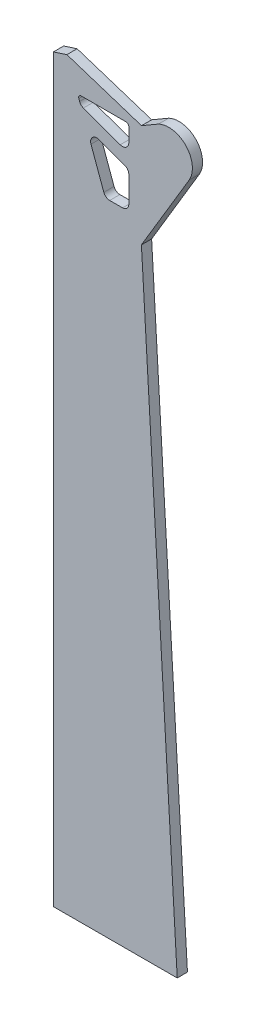
ISO-10303-21;
HEADER;
FILE_DESCRIPTION(('STEP AP214'),'2;1');
FILE_NAME('part.step','',(''),(''),'','','');
FILE_SCHEMA(('AUTOMOTIVE_DESIGN { 1 0 10303 214 1 1 1 1 }'));
ENDSEC;
DATA;
#1=APPLICATION_CONTEXT('core data for automotive mechanical design processes');
#2=APPLICATION_PROTOCOL_DEFINITION('international standard','automotive_design',2000,#1);
#3=PRODUCT_CONTEXT('',#1,'mechanical');
#4=PRODUCT('Part','Part','',(#3));
#5=PRODUCT_RELATED_PRODUCT_CATEGORY('part','',(#4));
#6=PRODUCT_DEFINITION_FORMATION('','',#4);
#7=PRODUCT_DEFINITION_CONTEXT('part definition',#1,'design');
#8=PRODUCT_DEFINITION('design','',#6,#7);
#9=PRODUCT_DEFINITION_SHAPE('','',#8);
#10=(LENGTH_UNIT() NAMED_UNIT(*) SI_UNIT(.MILLI.,.METRE.));
#11=(NAMED_UNIT(*) PLANE_ANGLE_UNIT() SI_UNIT($,.RADIAN.));
#12=(NAMED_UNIT(*) SI_UNIT($,.STERADIAN.) SOLID_ANGLE_UNIT());
#13=UNCERTAINTY_MEASURE_WITH_UNIT(LENGTH_MEASURE(1.E-05),#10,'distance_accuracy_value','');
#14=(GEOMETRIC_REPRESENTATION_CONTEXT(3) GLOBAL_UNCERTAINTY_ASSIGNED_CONTEXT((#13)) GLOBAL_UNIT_ASSIGNED_CONTEXT((#10,
#11,#12)) REPRESENTATION_CONTEXT('',''));
#15=CARTESIAN_POINT('',(0.,0.,0.));
#16=DIRECTION('',(0.,0.,1.));
#17=DIRECTION('',(1.,0.,0.));
#18=AXIS2_PLACEMENT_3D('',#15,#16,#17);
#19=CARTESIAN_POINT('',(28.6298346878982,-20.0325012091891,4.));
#20=DIRECTION('',(0.,0.,1.));
#21=DIRECTION('',(1.,0.,0.));
#22=AXIS2_PLACEMENT_3D('',#19,#20,#21);
#23=PLANE('',#22);
#24=DIRECTION('',(-0.951071645924449,0.308970426284716,0.));
#25=VECTOR('',#24,1.);
#26=CARTESIAN_POINT('',(-11.3096668241199,-6.06976293128026,4.));
#27=LINE('',#26,#25);
#28=CARTESIAN_POINT('',(17.9385185515101,-15.5714911578419,4.));
#29=VERTEX_POINT('',#28);
#30=CARTESIAN_POINT('',(-11.3096668241199,-6.06976293128026,4.));
#31=VERTEX_POINT('',#30);
#32=EDGE_CURVE('E318',#29,#31,#27,.T.);
#33=ORIENTED_EDGE('',*,*,#32,.T.);
#34=DIRECTION('',(-0.951147790313558,-0.308735940540837,0.));
#35=VECTOR('',#34,1.);
#36=CARTESIAN_POINT('',(-16.5920986699063,-7.78440347490604,4.));
#37=LINE('',#36,#35);
#38=CARTESIAN_POINT('',(-16.5920986699063,-7.78440347490604,4.));
#39=VERTEX_POINT('',#38);
#40=EDGE_CURVE('E321',#31,#39,#37,.T.);
#41=ORIENTED_EDGE('',*,*,#40,.T.);
#42=DIRECTION('',(0.,-1.,0.));
#43=VECTOR('',#42,1.);
#44=CARTESIAN_POINT('',(-16.5920986699063,-298.052484048209,4.));
#45=LINE('',#44,#43);
#46=CARTESIAN_POINT('',(-16.5920986699063,-298.052484048209,4.));
#47=VERTEX_POINT('',#46);
#48=EDGE_CURVE('E324',#39,#47,#45,.T.);
#49=ORIENTED_EDGE('',*,*,#48,.T.);
#50=DIRECTION('',(0.999999415520695,0.00108118373476207,0.));
#51=VECTOR('',#50,1.);
#52=CARTESIAN_POINT('',(31.9511618521957,-297.999999833824,4.));
#53=LINE('',#52,#51);
#54=CARTESIAN_POINT('',(31.9511618521957,-297.999999833824,4.));
#55=VERTEX_POINT('',#54);
#56=EDGE_CURVE('E326',#47,#55,#53,.T.);
#57=ORIENTED_EDGE('',*,*,#56,.T.);
#58=DIRECTION('',(-0.0579668894927901,0.998318506150482,0.));
#59=VECTOR('',#58,1.);
#60=CARTESIAN_POINT('',(17.9029399136455,-56.0584352185921,4.));
#61=LINE('',#60,#59);
#62=CARTESIAN_POINT('',(17.9029399136455,-56.0584352185921,4.));
#63=VERTEX_POINT('',#62);
#64=EDGE_CURVE('E328',#55,#63,#61,.T.);
#65=ORIENTED_EDGE('',*,*,#64,.T.);
#66=DIRECTION('',(0.512634877183394,0.85860671013868,0.));
#67=VECTOR('',#66,1.);
#68=CARTESIAN_POINT('',(36.6247857009395,-24.7014145892651,4.));
#69=LINE('',#68,#67);
#70=CARTESIAN_POINT('',(36.6247857009395,-24.7014145892651,4.));
#71=VERTEX_POINT('',#70);
#72=EDGE_CURVE('E330',#63,#71,#69,.T.);
#73=ORIENTED_EDGE('',*,*,#72,.T.);
#74=CARTESIAN_POINT('',(28.6298346878982,-20.0325012091891,4.));
#75=DIRECTION('',(0.,0.,1.));
#76=DIRECTION('',(1.,0.,0.));
#77=AXIS2_PLACEMENT_3D('',#74,#75,#76);
#78=CIRCLE('',#77,9.25840125786205);
#79=CARTESIAN_POINT('',(24.5925930532673,-11.7007142558889,4.));
#80=VERTEX_POINT('',#79);
#81=EDGE_CURVE('E332',#71,#80,#78,.T.);
#82=ORIENTED_EDGE('',*,*,#81,.T.);
#83=DIRECTION('',(-0.864386993126988,-0.502827133429456,0.));
#84=VECTOR('',#83,1.);
#85=CARTESIAN_POINT('',(17.9385185515101,-15.5714911578419,4.));
#86=LINE('',#85,#84);
#87=EDGE_CURVE('E334',#80,#29,#86,.T.);
#88=ORIENTED_EDGE('',*,*,#87,.T.);
#89=EDGE_LOOP('',(#33,#41,#49,#57,#65,#73,#82,#88));
#90=FACE_BOUND('',#89,.T.);
#91=DIRECTION('',(-1.,0.,0.));
#92=VECTOR('',#91,1.);
#93=CARTESIAN_POINT('',(11.95,-17.302075787855,4.));
#94=LINE('',#93,#92);
#95=CARTESIAN_POINT('',(11.95,-17.302075787855,4.));
#96=VERTEX_POINT('',#95);
#97=CARTESIAN_POINT('',(-5.70114217944184,-17.302075787855,4.));
#98=VERTEX_POINT('',#97);
#99=EDGE_CURVE('E261',#96,#98,#94,.T.);
#100=ORIENTED_EDGE('',*,*,#99,.F.);
#101=CARTESIAN_POINT('',(11.95,-18.302075787855,4.));
#102=DIRECTION('',(0.,0.,1.));
#103=DIRECTION('',(1.,0.,0.));
#104=AXIS2_PLACEMENT_3D('',#101,#102,#103);
#105=CIRCLE('',#104,1.00000000000001);
#106=CARTESIAN_POINT('',(12.95,-18.3020757878549,4.));
#107=VERTEX_POINT('',#106);
#108=EDGE_CURVE('E259',#107,#96,#105,.T.);
#109=ORIENTED_EDGE('',*,*,#108,.F.);
#110=DIRECTION('',(0.,1.,0.));
#111=VECTOR('',#110,1.);
#112=CARTESIAN_POINT('',(12.95,-18.3020757878549,4.));
#113=LINE('',#112,#111);
#114=CARTESIAN_POINT('',(12.95,-23.8785925996651,4.));
#115=VERTEX_POINT('',#114);
#116=EDGE_CURVE('E275',#115,#107,#113,.T.);
#117=ORIENTED_EDGE('',*,*,#116,.F.);
#118=CARTESIAN_POINT('',(10.45,-23.8785925996651,4.));
#119=DIRECTION('',(0.,0.,1.));
#120=DIRECTION('',(1.,0.,0.));
#121=AXIS2_PLACEMENT_3D('',#118,#119,#120);
#122=CIRCLE('',#121,2.5);
#123=CARTESIAN_POINT('',(9.59494964168551,-26.2278241516297,4.));
#124=VERTEX_POINT('',#123);
#125=EDGE_CURVE('E272',#124,#115,#122,.T.);
#126=ORIENTED_EDGE('',*,*,#125,.F.);
#127=DIRECTION('',(0.939692620785861,-0.342020143325799,0.));
#128=VECTOR('',#127,1.);
#129=CARTESIAN_POINT('',(9.59494964168551,-26.2278241516297,4.));
#130=LINE('',#129,#128);
#131=CARTESIAN_POINT('',(-4.84288181869834,-20.9728832526956,4.));
#132=VERTEX_POINT('',#131);
#133=EDGE_CURVE('E270',#132,#124,#130,.T.);
#134=ORIENTED_EDGE('',*,*,#133,.F.);
#135=CARTESIAN_POINT('',(-3.98783146038417,-18.6236517007308,4.));
#136=DIRECTION('',(0.,0.,1.));
#137=DIRECTION('',(1.,0.,0.));
#138=AXIS2_PLACEMENT_3D('',#135,#136,#137);
#139=CIRCLE('',#138,2.5);
#140=CARTESIAN_POINT('',(-6.33706301234895,-19.478702059045,4.));
#141=VERTEX_POINT('',#140);
#142=EDGE_CURVE('E268',#141,#132,#139,.T.);
#143=ORIENTED_EDGE('',*,*,#142,.F.);
#144=DIRECTION('',(0.342020143325663,-0.939692620785911,0.));
#145=VECTOR('',#144,1.);
#146=CARTESIAN_POINT('',(-6.64083480022774,-18.6440959311806,4.));
#147=LINE('',#146,#145);
#148=CARTESIAN_POINT('',(-6.64083480022774,-18.6440959311806,4.));
#149=VERTEX_POINT('',#148);
#150=EDGE_CURVE('E266',#149,#141,#147,.T.);
#151=ORIENTED_EDGE('',*,*,#150,.F.);
#152=CARTESIAN_POINT('',(-5.70114217944184,-18.302075787855,4.));
#153=DIRECTION('',(0.,0.,1.));
#154=DIRECTION('',(-1.,0.,0.));
#155=AXIS2_PLACEMENT_3D('',#152,#153,#154);
#156=CIRCLE('',#155,0.999999999999999);
#157=EDGE_CURVE('E264',#98,#149,#156,.T.);
#158=ORIENTED_EDGE('',*,*,#157,.F.);
#159=EDGE_LOOP('',(#100,#109,#117,#126,#134,#143,#151,#158));
#160=FACE_BOUND('',#159,.T.);
#161=DIRECTION('',(0.342020143325663,-0.93969262078591,0.));
#162=VECTOR('',#161,1.);
#163=CARTESIAN_POINT('',(-1.86433279978723,-31.767427321371,4.));
#164=LINE('',#163,#162);
#165=CARTESIAN_POINT('',(-1.86433279978723,-31.767427321371,4.));
#166=VERTEX_POINT('',#165);
#167=CARTESIAN_POINT('',(3.16592584107175,-45.5879493511479,4.));
#168=VERTEX_POINT('',#167);
#169=EDGE_CURVE('E202',#166,#168,#164,.T.);
#170=ORIENTED_EDGE('',*,*,#169,.F.);
#171=CARTESIAN_POINT('',(0.437914121138236,-30.9294779702231,4.));
#172=DIRECTION('',(0.,0.,1.));
#173=DIRECTION('',(-1.,0.,0.));
#174=AXIS2_PLACEMENT_3D('',#171,#172,#173);
#175=CIRCLE('',#174,2.45);
#176=CARTESIAN_POINT('',(1.27586347228618,-28.6272310492977,4.));
#177=VERTEX_POINT('',#176);
#178=EDGE_CURVE('E194',#177,#166,#175,.T.);
#179=ORIENTED_EDGE('',*,*,#178,.F.);
#180=DIRECTION('',(-0.939692620785907,0.342020143325672,0.));
#181=VECTOR('',#180,1.);
#182=CARTESIAN_POINT('',(1.27586347228618,-28.6272310492977,4.));
#183=LINE('',#182,#181);
#184=CARTESIAN_POINT('',(11.3379493511479,-32.2895308038337,4.));
#185=VERTEX_POINT('',#184);
#186=EDGE_CURVE('E227',#185,#177,#183,.T.);
#187=ORIENTED_EDGE('',*,*,#186,.F.);
#188=CARTESIAN_POINT('',(10.5,-34.5917777247591,4.));
#189=DIRECTION('',(0.,0.,1.));
#190=DIRECTION('',(-1.,0.,0.));
#191=AXIS2_PLACEMENT_3D('',#188,#189,#190);
#192=CIRCLE('',#191,2.45);
#193=CARTESIAN_POINT('',(12.95,-34.5917777247591,4.));
#194=VERTEX_POINT('',#193);
#195=EDGE_CURVE('E225',#194,#185,#192,.T.);
#196=ORIENTED_EDGE('',*,*,#195,.F.);
#197=DIRECTION('',(0.,1.,0.));
#198=VECTOR('',#197,1.);
#199=CARTESIAN_POINT('',(12.95,-34.5917777247591,4.));
#200=LINE('',#199,#198);
#201=CARTESIAN_POINT('',(12.95,-44.75,4.));
#202=VERTEX_POINT('',#201);
#203=EDGE_CURVE('E223',#202,#194,#200,.T.);
#204=ORIENTED_EDGE('',*,*,#203,.F.);
#205=CARTESIAN_POINT('',(10.5,-44.75,4.));
#206=DIRECTION('',(0.,0.,1.));
#207=DIRECTION('',(1.,0.,0.));
#208=AXIS2_PLACEMENT_3D('',#205,#206,#207);
#209=CIRCLE('',#208,2.45);
#210=CARTESIAN_POINT('',(10.5,-47.2,4.));
#211=VERTEX_POINT('',#210);
#212=EDGE_CURVE('E221',#211,#202,#209,.T.);
#213=ORIENTED_EDGE('',*,*,#212,.F.);
#214=DIRECTION('',(1.,0.,0.));
#215=VECTOR('',#214,1.);
#216=CARTESIAN_POINT('',(5.46817276199725,-47.2,4.));
#217=LINE('',#216,#215);
#218=CARTESIAN_POINT('',(5.46817276199725,-47.2,4.));
#219=VERTEX_POINT('',#218);
#220=EDGE_CURVE('E217',#219,#211,#217,.T.);
#221=ORIENTED_EDGE('',*,*,#220,.F.);
#222=CARTESIAN_POINT('',(5.46817276199724,-44.75,4.));
#223=DIRECTION('',(0.,0.,1.));
#224=DIRECTION('',(-1.,0.,0.));
#225=AXIS2_PLACEMENT_3D('',#222,#223,#224);
#226=CIRCLE('',#225,2.45);
#227=EDGE_CURVE('E215',#168,#219,#226,.T.);
#228=ORIENTED_EDGE('',*,*,#227,.F.);
#229=EDGE_LOOP('',(#170,#179,#187,#196,#204,#213,#221,#228));
#230=FACE_BOUND('',#229,.T.);
#231=ADVANCED_FACE('F33',(#90,#160,#230),#23,.T.);
#232=CARTESIAN_POINT('',(28.6298346878982,-20.0325012091891,0.));
#233=DIRECTION('',(0.,0.,1.));
#234=DIRECTION('',(1.,0.,0.));
#235=AXIS2_PLACEMENT_3D('',#232,#233,#234);
#236=PLANE('',#235);
#237=CARTESIAN_POINT('',(11.95,-18.302075787855,0.));
#238=DIRECTION('',(0.,0.,1.));
#239=DIRECTION('',(1.,0.,0.));
#240=AXIS2_PLACEMENT_3D('',#237,#238,#239);
#241=CIRCLE('',#240,1.00000000000001);
#242=CARTESIAN_POINT('',(12.95,-18.3020757878549,0.));
#243=VERTEX_POINT('',#242);
#244=CARTESIAN_POINT('',(11.95,-17.302075787855,0.));
#245=VERTEX_POINT('',#244);
#246=EDGE_CURVE('E210',#243,#245,#241,.T.);
#247=ORIENTED_EDGE('',*,*,#246,.T.);
#248=DIRECTION('',(-1.,0.,0.));
#249=VECTOR('',#248,1.);
#250=CARTESIAN_POINT('',(11.95,-17.302075787855,0.));
#251=LINE('',#250,#249);
#252=CARTESIAN_POINT('',(-5.70114217944184,-17.302075787855,0.));
#253=VERTEX_POINT('',#252);
#254=EDGE_CURVE('E280',#245,#253,#251,.T.);
#255=ORIENTED_EDGE('',*,*,#254,.T.);
#256=CARTESIAN_POINT('',(-5.70114217944184,-18.302075787855,0.));
#257=DIRECTION('',(0.,0.,1.));
#258=DIRECTION('',(-1.,0.,0.));
#259=AXIS2_PLACEMENT_3D('',#256,#257,#258);
#260=CIRCLE('',#259,0.999999999999999);
#261=CARTESIAN_POINT('',(-6.64083480022774,-18.6440959311806,0.));
#262=VERTEX_POINT('',#261);
#263=EDGE_CURVE('E283',#253,#262,#260,.T.);
#264=ORIENTED_EDGE('',*,*,#263,.T.);
#265=DIRECTION('',(0.342020143325663,-0.939692620785911,0.));
#266=VECTOR('',#265,1.);
#267=CARTESIAN_POINT('',(-6.64083480022774,-18.6440959311806,0.));
#268=LINE('',#267,#266);
#269=CARTESIAN_POINT('',(-6.33706301234895,-19.478702059045,0.));
#270=VERTEX_POINT('',#269);
#271=EDGE_CURVE('E286',#262,#270,#268,.T.);
#272=ORIENTED_EDGE('',*,*,#271,.T.);
#273=CARTESIAN_POINT('',(-3.98783146038417,-18.6236517007308,0.));
#274=DIRECTION('',(0.,0.,1.));
#275=DIRECTION('',(1.,0.,0.));
#276=AXIS2_PLACEMENT_3D('',#273,#274,#275);
#277=CIRCLE('',#276,2.5);
#278=CARTESIAN_POINT('',(-4.84288181869834,-20.9728832526956,0.));
#279=VERTEX_POINT('',#278);
#280=EDGE_CURVE('E289',#270,#279,#277,.T.);
#281=ORIENTED_EDGE('',*,*,#280,.T.);
#282=DIRECTION('',(0.939692620785861,-0.342020143325799,0.));
#283=VECTOR('',#282,1.);
#284=CARTESIAN_POINT('',(9.59494964168551,-26.2278241516297,0.));
#285=LINE('',#284,#283);
#286=CARTESIAN_POINT('',(9.59494964168551,-26.2278241516297,0.));
#287=VERTEX_POINT('',#286);
#288=EDGE_CURVE('E292',#279,#287,#285,.T.);
#289=ORIENTED_EDGE('',*,*,#288,.T.);
#290=CARTESIAN_POINT('',(10.45,-23.8785925996651,0.));
#291=DIRECTION('',(0.,0.,1.));
#292=DIRECTION('',(1.,0.,0.));
#293=AXIS2_PLACEMENT_3D('',#290,#291,#292);
#294=CIRCLE('',#293,2.5);
#295=CARTESIAN_POINT('',(12.95,-23.8785925996651,0.));
#296=VERTEX_POINT('',#295);
#297=EDGE_CURVE('E295',#287,#296,#294,.T.);
#298=ORIENTED_EDGE('',*,*,#297,.T.);
#299=DIRECTION('',(0.,1.,0.));
#300=VECTOR('',#299,1.);
#301=CARTESIAN_POINT('',(12.95,-18.3020757878549,0.));
#302=LINE('',#301,#300);
#303=EDGE_CURVE('E262',#296,#243,#302,.T.);
#304=ORIENTED_EDGE('',*,*,#303,.T.);
#305=EDGE_LOOP('',(#247,#255,#264,#272,#281,#289,#298,#304));
#306=FACE_BOUND('',#305,.T.);
#307=DIRECTION('',(-0.951071645924449,0.308970426284716,0.));
#308=VECTOR('',#307,1.);
#309=CARTESIAN_POINT('',(-11.3096668241199,-6.06976293128026,0.));
#310=LINE('',#309,#308);
#311=CARTESIAN_POINT('',(17.9385185515101,-15.5714911578419,0.));
#312=VERTEX_POINT('',#311);
#313=CARTESIAN_POINT('',(-11.3096668241199,-6.06976293128026,0.));
#314=VERTEX_POINT('',#313);
#315=EDGE_CURVE('E317',#312,#314,#310,.T.);
#316=ORIENTED_EDGE('',*,*,#315,.F.);
#317=DIRECTION('',(-0.864386993126988,-0.502827133429456,0.));
#318=VECTOR('',#317,1.);
#319=CARTESIAN_POINT('',(17.9385185515101,-15.5714911578419,0.));
#320=LINE('',#319,#318);
#321=CARTESIAN_POINT('',(24.5925930532673,-11.7007142558889,0.));
#322=VERTEX_POINT('',#321);
#323=EDGE_CURVE('E322',#322,#312,#320,.T.);
#324=ORIENTED_EDGE('',*,*,#323,.F.);
#325=CARTESIAN_POINT('',(28.6298346878982,-20.0325012091891,0.));
#326=DIRECTION('',(0.,0.,1.));
#327=DIRECTION('',(1.,0.,0.));
#328=AXIS2_PLACEMENT_3D('',#325,#326,#327);
#329=CIRCLE('',#328,9.25840125786205);
#330=CARTESIAN_POINT('',(36.6247857009395,-24.7014145892651,0.));
#331=VERTEX_POINT('',#330);
#332=EDGE_CURVE('E349',#331,#322,#329,.T.);
#333=ORIENTED_EDGE('',*,*,#332,.F.);
#334=DIRECTION('',(0.512634877183394,0.85860671013868,0.));
#335=VECTOR('',#334,1.);
#336=CARTESIAN_POINT('',(36.6247857009395,-24.7014145892651,0.));
#337=LINE('',#336,#335);
#338=CARTESIAN_POINT('',(17.9029399136455,-56.0584352185921,0.));
#339=VERTEX_POINT('',#338);
#340=EDGE_CURVE('E347',#339,#331,#337,.T.);
#341=ORIENTED_EDGE('',*,*,#340,.F.);
#342=DIRECTION('',(-0.0579668894927901,0.998318506150482,0.));
#343=VECTOR('',#342,1.);
#344=CARTESIAN_POINT('',(17.9029399136455,-56.0584352185921,0.));
#345=LINE('',#344,#343);
#346=CARTESIAN_POINT('',(31.9511618521957,-297.999999833824,0.));
#347=VERTEX_POINT('',#346);
#348=EDGE_CURVE('E345',#347,#339,#345,.T.);
#349=ORIENTED_EDGE('',*,*,#348,.F.);
#350=DIRECTION('',(0.999999415520695,0.00108118373476207,0.));
#351=VECTOR('',#350,1.);
#352=CARTESIAN_POINT('',(31.9511618521957,-297.999999833824,0.));
#353=LINE('',#352,#351);
#354=CARTESIAN_POINT('',(-16.5920986699063,-298.052484048209,0.));
#355=VERTEX_POINT('',#354);
#356=EDGE_CURVE('E343',#355,#347,#353,.T.);
#357=ORIENTED_EDGE('',*,*,#356,.F.);
#358=DIRECTION('',(0.,-1.,0.));
#359=VECTOR('',#358,1.);
#360=CARTESIAN_POINT('',(-16.5920986699063,-298.052484048209,0.));
#361=LINE('',#360,#359);
#362=CARTESIAN_POINT('',(-16.5920986699063,-7.78440347490604,0.));
#363=VERTEX_POINT('',#362);
#364=EDGE_CURVE('E341',#363,#355,#361,.T.);
#365=ORIENTED_EDGE('',*,*,#364,.F.);
#366=DIRECTION('',(-0.951147790313558,-0.308735940540837,0.));
#367=VECTOR('',#366,1.);
#368=CARTESIAN_POINT('',(-16.5920986699063,-7.78440347490604,0.));
#369=LINE('',#368,#367);
#370=EDGE_CURVE('E339',#314,#363,#369,.T.);
#371=ORIENTED_EDGE('',*,*,#370,.F.);
#372=EDGE_LOOP('',(#316,#324,#333,#341,#349,#357,#365,#371));
#373=FACE_BOUND('',#372,.T.);
#374=CARTESIAN_POINT('',(0.437914121138236,-30.9294779702231,0.));
#375=DIRECTION('',(0.,0.,1.));
#376=DIRECTION('',(-1.,0.,0.));
#377=AXIS2_PLACEMENT_3D('',#374,#375,#376);
#378=CIRCLE('',#377,2.45);
#379=CARTESIAN_POINT('',(1.27586347228618,-28.6272310492977,0.));
#380=VERTEX_POINT('',#379);
#381=CARTESIAN_POINT('',(-1.86433279978723,-31.767427321371,0.));
#382=VERTEX_POINT('',#381);
#383=EDGE_CURVE('E56',#380,#382,#378,.T.);
#384=ORIENTED_EDGE('',*,*,#383,.T.);
#385=DIRECTION('',(0.342020143325663,-0.93969262078591,0.));
#386=VECTOR('',#385,1.);
#387=CARTESIAN_POINT('',(-1.86433279978723,-31.767427321371,0.));
#388=LINE('',#387,#386);
#389=CARTESIAN_POINT('',(3.16592584107175,-45.5879493511479,0.));
#390=VERTEX_POINT('',#389);
#391=EDGE_CURVE('E209',#382,#390,#388,.T.);
#392=ORIENTED_EDGE('',*,*,#391,.T.);
#393=CARTESIAN_POINT('',(5.46817276199724,-44.75,0.));
#394=DIRECTION('',(0.,0.,1.));
#395=DIRECTION('',(-1.,0.,0.));
#396=AXIS2_PLACEMENT_3D('',#393,#394,#395);
#397=CIRCLE('',#396,2.45);
#398=CARTESIAN_POINT('',(5.46817276199725,-47.2,0.));
#399=VERTEX_POINT('',#398);
#400=EDGE_CURVE('E231',#390,#399,#397,.T.);
#401=ORIENTED_EDGE('',*,*,#400,.T.);
#402=DIRECTION('',(1.,0.,0.));
#403=VECTOR('',#402,1.);
#404=CARTESIAN_POINT('',(5.46817276199725,-47.2,0.));
#405=LINE('',#404,#403);
#406=CARTESIAN_POINT('',(10.5,-47.2,0.));
#407=VERTEX_POINT('',#406);
#408=EDGE_CURVE('E234',#399,#407,#405,.T.);
#409=ORIENTED_EDGE('',*,*,#408,.T.);
#410=CARTESIAN_POINT('',(10.5,-44.75,0.));
#411=DIRECTION('',(0.,0.,1.));
#412=DIRECTION('',(1.,0.,0.));
#413=AXIS2_PLACEMENT_3D('',#410,#411,#412);
#414=CIRCLE('',#413,2.45);
#415=CARTESIAN_POINT('',(12.95,-44.75,0.));
#416=VERTEX_POINT('',#415);
#417=EDGE_CURVE('E237',#407,#416,#414,.T.);
#418=ORIENTED_EDGE('',*,*,#417,.T.);
#419=DIRECTION('',(0.,1.,0.));
#420=VECTOR('',#419,1.);
#421=CARTESIAN_POINT('',(12.95,-34.5917777247591,0.));
#422=LINE('',#421,#420);
#423=CARTESIAN_POINT('',(12.95,-34.5917777247591,0.));
#424=VERTEX_POINT('',#423);
#425=EDGE_CURVE('E240',#416,#424,#422,.T.);
#426=ORIENTED_EDGE('',*,*,#425,.T.);
#427=CARTESIAN_POINT('',(10.5,-34.5917777247591,0.));
#428=DIRECTION('',(0.,0.,1.));
#429=DIRECTION('',(-1.,0.,0.));
#430=AXIS2_PLACEMENT_3D('',#427,#428,#429);
#431=CIRCLE('',#430,2.45);
#432=CARTESIAN_POINT('',(11.3379493511479,-32.2895308038337,0.));
#433=VERTEX_POINT('',#432);
#434=EDGE_CURVE('E243',#424,#433,#431,.T.);
#435=ORIENTED_EDGE('',*,*,#434,.T.);
#436=DIRECTION('',(-0.939692620785907,0.342020143325672,0.));
#437=VECTOR('',#436,1.);
#438=CARTESIAN_POINT('',(1.27586347228618,-28.6272310492977,0.));
#439=LINE('',#438,#437);
#440=EDGE_CURVE('E203',#433,#380,#439,.T.);
#441=ORIENTED_EDGE('',*,*,#440,.T.);
#442=EDGE_LOOP('',(#384,#392,#401,#409,#418,#426,#435,#441));
#443=FACE_BOUND('',#442,.T.);
#444=ADVANCED_FACE('F379',(#306,#373,#443),#236,.F.);
#445=CARTESIAN_POINT('',(-11.3096668241199,-6.06976293128026,4.));
#446=DIRECTION('',(-0.308970426284716,-0.951071645924449,0.));
#447=DIRECTION('',(0.951071645924449,-0.308970426284716,0.));
#448=AXIS2_PLACEMENT_3D('',#445,#446,#447);
#449=PLANE('',#448);
#450=ORIENTED_EDGE('',*,*,#315,.T.);
#451=DIRECTION('',(0.,0.,-1.));
#452=VECTOR('',#451,1.);
#453=CARTESIAN_POINT('',(-11.3096668241199,-6.06976293128026,4.));
#454=LINE('',#453,#452);
#455=EDGE_CURVE('E11',#31,#314,#454,.T.);
#456=ORIENTED_EDGE('',*,*,#455,.F.);
#457=ORIENTED_EDGE('',*,*,#32,.F.);
#458=DIRECTION('',(0.,0.,-1.));
#459=VECTOR('',#458,1.);
#460=CARTESIAN_POINT('',(17.9385185515101,-15.5714911578419,4.));
#461=LINE('',#460,#459);
#462=EDGE_CURVE('E336',#29,#312,#461,.T.);
#463=ORIENTED_EDGE('',*,*,#462,.T.);
#464=EDGE_LOOP('',(#450,#456,#457,#463));
#465=FACE_BOUND('',#464,.T.);
#466=ADVANCED_FACE('F35',(#465),#449,.F.);
#467=CARTESIAN_POINT('',(-16.5920986699063,-7.78440347490604,4.));
#468=DIRECTION('',(0.308735940540837,-0.951147790313558,0.));
#469=DIRECTION('',(0.951147790313558,0.308735940540837,0.));
#470=AXIS2_PLACEMENT_3D('',#467,#468,#469);
#471=PLANE('',#470);
#472=ORIENTED_EDGE('',*,*,#370,.T.);
#473=DIRECTION('',(0.,0.,-1.));
#474=VECTOR('',#473,1.);
#475=CARTESIAN_POINT('',(-16.5920986699063,-7.78440347490604,4.));
#476=LINE('',#475,#474);
#477=EDGE_CURVE('E41',#39,#363,#476,.T.);
#478=ORIENTED_EDGE('',*,*,#477,.F.);
#479=ORIENTED_EDGE('',*,*,#40,.F.);
#480=ORIENTED_EDGE('',*,*,#455,.T.);
#481=EDGE_LOOP('',(#472,#478,#479,#480));
#482=FACE_BOUND('',#481,.T.);
#483=ADVANCED_FACE('F397',(#482),#471,.F.);
#484=CARTESIAN_POINT('',(-16.5920986699063,-298.052484048209,4.));
#485=DIRECTION('',(1.,0.,0.));
#486=DIRECTION('',(0.,0.,-1.));
#487=AXIS2_PLACEMENT_3D('',#484,#485,#486);
#488=PLANE('',#487);
#489=ORIENTED_EDGE('',*,*,#364,.T.);
#490=DIRECTION('',(0.,0.,-1.));
#491=VECTOR('',#490,1.);
#492=CARTESIAN_POINT('',(-16.5920986699063,-298.052484048209,4.));
#493=LINE('',#492,#491);
#494=EDGE_CURVE('E366',#47,#355,#493,.T.);
#495=ORIENTED_EDGE('',*,*,#494,.F.);
#496=ORIENTED_EDGE('',*,*,#48,.F.);
#497=ORIENTED_EDGE('',*,*,#477,.T.);
#498=EDGE_LOOP('',(#489,#495,#496,#497));
#499=FACE_BOUND('',#498,.T.);
#500=ADVANCED_FACE('F373',(#499),#488,.F.);
#501=CARTESIAN_POINT('',(31.9511618521957,-297.999999833824,4.));
#502=DIRECTION('',(-0.00108118373476207,0.999999415520695,0.));
#503=DIRECTION('',(-0.999999415520695,-0.00108118373476207,0.));
#504=AXIS2_PLACEMENT_3D('',#501,#502,#503);
#505=PLANE('',#504);
#506=ORIENTED_EDGE('',*,*,#356,.T.);
#507=DIRECTION('',(0.,0.,-1.));
#508=VECTOR('',#507,1.);
#509=CARTESIAN_POINT('',(31.9511618521957,-297.999999833824,4.));
#510=LINE('',#509,#508);
#511=EDGE_CURVE('E363',#55,#347,#510,.T.);
#512=ORIENTED_EDGE('',*,*,#511,.F.);
#513=ORIENTED_EDGE('',*,*,#56,.F.);
#514=ORIENTED_EDGE('',*,*,#494,.T.);
#515=EDGE_LOOP('',(#506,#512,#513,#514));
#516=FACE_BOUND('',#515,.T.);
#517=ADVANCED_FACE('F385',(#516),#505,.F.);
#518=CARTESIAN_POINT('',(17.9029399136455,-56.0584352185921,4.));
#519=DIRECTION('',(-0.998318506150482,-0.0579668894927901,0.));
#520=DIRECTION('',(0.0579668894927901,-0.998318506150482,0.));
#521=AXIS2_PLACEMENT_3D('',#518,#519,#520);
#522=PLANE('',#521);
#523=ORIENTED_EDGE('',*,*,#348,.T.);
#524=DIRECTION('',(0.,0.,-1.));
#525=VECTOR('',#524,1.);
#526=CARTESIAN_POINT('',(17.9029399136455,-56.0584352185921,4.));
#527=LINE('',#526,#525);
#528=EDGE_CURVE('E360',#63,#339,#527,.T.);
#529=ORIENTED_EDGE('',*,*,#528,.F.);
#530=ORIENTED_EDGE('',*,*,#64,.F.);
#531=ORIENTED_EDGE('',*,*,#511,.T.);
#532=EDGE_LOOP('',(#523,#529,#530,#531));
#533=FACE_BOUND('',#532,.T.);
#534=ADVANCED_FACE('F389',(#533),#522,.F.);
#535=CARTESIAN_POINT('',(36.6247857009395,-24.7014145892651,4.));
#536=DIRECTION('',(-0.85860671013868,0.512634877183394,0.));
#537=DIRECTION('',(-0.512634877183394,-0.85860671013868,0.));
#538=AXIS2_PLACEMENT_3D('',#535,#536,#537);
#539=PLANE('',#538);
#540=ORIENTED_EDGE('',*,*,#340,.T.);
#541=DIRECTION('',(0.,0.,-1.));
#542=VECTOR('',#541,1.);
#543=CARTESIAN_POINT('',(36.6247857009395,-24.7014145892651,4.));
#544=LINE('',#543,#542);
#545=EDGE_CURVE('E357',#71,#331,#544,.T.);
#546=ORIENTED_EDGE('',*,*,#545,.F.);
#547=ORIENTED_EDGE('',*,*,#72,.F.);
#548=ORIENTED_EDGE('',*,*,#528,.T.);
#549=EDGE_LOOP('',(#540,#546,#547,#548));
#550=FACE_BOUND('',#549,.T.);
#551=ADVANCED_FACE('F410',(#550),#539,.F.);
#552=CARTESIAN_POINT('',(28.6298346878982,-20.0325012091891,4.));
#553=DIRECTION('',(0.,0.,-1.));
#554=DIRECTION('',(-1.,0.,0.));
#555=AXIS2_PLACEMENT_3D('',#552,#553,#554);
#556=CYLINDRICAL_SURFACE('',#555,9.25840125786205);
#557=ORIENTED_EDGE('',*,*,#332,.T.);
#558=DIRECTION('',(0.,0.,-1.));
#559=VECTOR('',#558,1.);
#560=CARTESIAN_POINT('',(24.5925930532673,-11.7007142558889,4.));
#561=LINE('',#560,#559);
#562=EDGE_CURVE('E354',#80,#322,#561,.T.);
#563=ORIENTED_EDGE('',*,*,#562,.F.);
#564=ORIENTED_EDGE('',*,*,#81,.F.);
#565=ORIENTED_EDGE('',*,*,#545,.T.);
#566=EDGE_LOOP('',(#557,#563,#564,#565));
#567=FACE_BOUND('',#566,.T.);
#568=ADVANCED_FACE('F408',(#567),#556,.T.);
#569=CARTESIAN_POINT('',(17.9385185515101,-15.5714911578419,4.));
#570=DIRECTION('',(0.502827133429456,-0.864386993126988,0.));
#571=DIRECTION('',(0.864386993126988,0.502827133429456,0.));
#572=AXIS2_PLACEMENT_3D('',#569,#570,#571);
#573=PLANE('',#572);
#574=ORIENTED_EDGE('',*,*,#323,.T.);
#575=ORIENTED_EDGE('',*,*,#462,.F.);
#576=ORIENTED_EDGE('',*,*,#87,.F.);
#577=ORIENTED_EDGE('',*,*,#562,.T.);
#578=EDGE_LOOP('',(#574,#575,#576,#577));
#579=FACE_BOUND('',#578,.T.);
#580=ADVANCED_FACE('F403',(#579),#573,.F.);
#581=CARTESIAN_POINT('',(11.95,-18.302075787855,4.));
#582=DIRECTION('',(0.,0.,-1.));
#583=DIRECTION('',(-1.,0.,0.));
#584=AXIS2_PLACEMENT_3D('',#581,#582,#583);
#585=CYLINDRICAL_SURFACE('',#584,1.00000000000001);
#586=ORIENTED_EDGE('',*,*,#246,.F.);
#587=DIRECTION('',(0.,0.,-1.));
#588=VECTOR('',#587,1.);
#589=CARTESIAN_POINT('',(12.95,-18.3020757878549,4.));
#590=LINE('',#589,#588);
#591=EDGE_CURVE('E277',#107,#243,#590,.T.);
#592=ORIENTED_EDGE('',*,*,#591,.F.);
#593=ORIENTED_EDGE('',*,*,#108,.T.);
#594=DIRECTION('',(0.,0.,-1.));
#595=VECTOR('',#594,1.);
#596=CARTESIAN_POINT('',(11.95,-17.302075787855,4.));
#597=LINE('',#596,#595);
#598=EDGE_CURVE('E314',#96,#245,#597,.T.);
#599=ORIENTED_EDGE('',*,*,#598,.T.);
#600=EDGE_LOOP('',(#586,#592,#593,#599));
#601=FACE_BOUND('',#600,.T.);
#602=ADVANCED_FACE('F427',(#601),#585,.F.);
#603=CARTESIAN_POINT('',(11.95,-17.302075787855,4.));
#604=DIRECTION('',(0.,-1.,0.));
#605=DIRECTION('',(1.,0.,0.));
#606=AXIS2_PLACEMENT_3D('',#603,#604,#605);
#607=PLANE('',#606);
#608=ORIENTED_EDGE('',*,*,#254,.F.);
#609=ORIENTED_EDGE('',*,*,#598,.F.);
#610=ORIENTED_EDGE('',*,*,#99,.T.);
#611=DIRECTION('',(0.,0.,-1.));
#612=VECTOR('',#611,1.);
#613=CARTESIAN_POINT('',(-5.70114217944184,-17.302075787855,4.));
#614=LINE('',#613,#612);
#615=EDGE_CURVE('E312',#98,#253,#614,.T.);
#616=ORIENTED_EDGE('',*,*,#615,.T.);
#617=EDGE_LOOP('',(#608,#609,#610,#616));
#618=FACE_BOUND('',#617,.T.);
#619=ADVANCED_FACE('F434',(#618),#607,.T.);
#620=CARTESIAN_POINT('',(-5.70114217944184,-18.302075787855,4.));
#621=DIRECTION('',(0.,0.,-1.));
#622=DIRECTION('',(-1.,0.,0.));
#623=AXIS2_PLACEMENT_3D('',#620,#621,#622);
#624=CYLINDRICAL_SURFACE('',#623,0.999999999999999);
#625=ORIENTED_EDGE('',*,*,#263,.F.);
#626=ORIENTED_EDGE('',*,*,#615,.F.);
#627=ORIENTED_EDGE('',*,*,#157,.T.);
#628=DIRECTION('',(0.,0.,-1.));
#629=VECTOR('',#628,1.);
#630=CARTESIAN_POINT('',(-6.64083480022774,-18.6440959311806,4.));
#631=LINE('',#630,#629);
#632=EDGE_CURVE('E310',#149,#262,#631,.T.);
#633=ORIENTED_EDGE('',*,*,#632,.T.);
#634=EDGE_LOOP('',(#625,#626,#627,#633));
#635=FACE_BOUND('',#634,.T.);
#636=ADVANCED_FACE('F439',(#635),#624,.F.);
#637=CARTESIAN_POINT('',(-6.64083480022774,-18.6440959311806,4.));
#638=DIRECTION('',(0.939692620785911,0.342020143325663,0.));
#639=DIRECTION('',(-0.342020143325663,0.939692620785911,0.));
#640=AXIS2_PLACEMENT_3D('',#637,#638,#639);
#641=PLANE('',#640);
#642=ORIENTED_EDGE('',*,*,#271,.F.);
#643=ORIENTED_EDGE('',*,*,#632,.F.);
#644=ORIENTED_EDGE('',*,*,#150,.T.);
#645=DIRECTION('',(0.,0.,-1.));
#646=VECTOR('',#645,1.);
#647=CARTESIAN_POINT('',(-6.33706301234895,-19.478702059045,4.));
#648=LINE('',#647,#646);
#649=EDGE_CURVE('E308',#141,#270,#648,.T.);
#650=ORIENTED_EDGE('',*,*,#649,.T.);
#651=EDGE_LOOP('',(#642,#643,#644,#650));
#652=FACE_BOUND('',#651,.T.);
#653=ADVANCED_FACE('F464',(#652),#641,.T.);
#654=CARTESIAN_POINT('',(-3.98783146038417,-18.6236517007308,4.));
#655=DIRECTION('',(0.,0.,-1.));
#656=DIRECTION('',(-1.,0.,0.));
#657=AXIS2_PLACEMENT_3D('',#654,#655,#656);
#658=CYLINDRICAL_SURFACE('',#657,2.5);
#659=ORIENTED_EDGE('',*,*,#280,.F.);
#660=ORIENTED_EDGE('',*,*,#649,.F.);
#661=ORIENTED_EDGE('',*,*,#142,.T.);
#662=DIRECTION('',(0.,0.,-1.));
#663=VECTOR('',#662,1.);
#664=CARTESIAN_POINT('',(-4.84288181869834,-20.9728832526956,4.));
#665=LINE('',#664,#663);
#666=EDGE_CURVE('E306',#132,#279,#665,.T.);
#667=ORIENTED_EDGE('',*,*,#666,.T.);
#668=EDGE_LOOP('',(#659,#660,#661,#667));
#669=FACE_BOUND('',#668,.T.);
#670=ADVANCED_FACE('F469',(#669),#658,.F.);
#671=CARTESIAN_POINT('',(9.59494964168551,-26.2278241516297,4.));
#672=DIRECTION('',(0.342020143325799,0.939692620785861,0.));
#673=DIRECTION('',(-0.939692620785861,0.342020143325799,0.));
#674=AXIS2_PLACEMENT_3D('',#671,#672,#673);
#675=PLANE('',#674);
#676=ORIENTED_EDGE('',*,*,#288,.F.);
#677=ORIENTED_EDGE('',*,*,#666,.F.);
#678=ORIENTED_EDGE('',*,*,#133,.T.);
#679=DIRECTION('',(0.,0.,-1.));
#680=VECTOR('',#679,1.);
#681=CARTESIAN_POINT('',(9.59494964168551,-26.2278241516297,4.));
#682=LINE('',#681,#680);
#683=EDGE_CURVE('E304',#124,#287,#682,.T.);
#684=ORIENTED_EDGE('',*,*,#683,.T.);
#685=EDGE_LOOP('',(#676,#677,#678,#684));
#686=FACE_BOUND('',#685,.T.);
#687=ADVANCED_FACE('F472',(#686),#675,.T.);
#688=CARTESIAN_POINT('',(10.45,-23.8785925996651,4.));
#689=DIRECTION('',(0.,0.,-1.));
#690=DIRECTION('',(-1.,0.,0.));
#691=AXIS2_PLACEMENT_3D('',#688,#689,#690);
#692=CYLINDRICAL_SURFACE('',#691,2.5);
#693=ORIENTED_EDGE('',*,*,#297,.F.);
#694=ORIENTED_EDGE('',*,*,#683,.F.);
#695=ORIENTED_EDGE('',*,*,#125,.T.);
#696=DIRECTION('',(0.,0.,-1.));
#697=VECTOR('',#696,1.);
#698=CARTESIAN_POINT('',(12.95,-23.8785925996651,4.));
#699=LINE('',#698,#697);
#700=EDGE_CURVE('E302',#115,#296,#699,.T.);
#701=ORIENTED_EDGE('',*,*,#700,.T.);
#702=EDGE_LOOP('',(#693,#694,#695,#701));
#703=FACE_BOUND('',#702,.T.);
#704=ADVANCED_FACE('F452',(#703),#692,.F.);
#705=CARTESIAN_POINT('',(12.95,-18.3020757878549,4.));
#706=DIRECTION('',(-1.,0.,0.));
#707=DIRECTION('',(0.,-1.,0.));
#708=AXIS2_PLACEMENT_3D('',#705,#706,#707);
#709=PLANE('',#708);
#710=ORIENTED_EDGE('',*,*,#303,.F.);
#711=ORIENTED_EDGE('',*,*,#700,.F.);
#712=ORIENTED_EDGE('',*,*,#116,.T.);
#713=ORIENTED_EDGE('',*,*,#591,.T.);
#714=EDGE_LOOP('',(#710,#711,#712,#713));
#715=FACE_BOUND('',#714,.T.);
#716=ADVANCED_FACE('F446',(#715),#709,.T.);
#717=CARTESIAN_POINT('',(0.437914121138236,-30.9294779702231,4.));
#718=DIRECTION('',(0.,0.,-1.));
#719=DIRECTION('',(-1.,0.,0.));
#720=AXIS2_PLACEMENT_3D('',#717,#718,#719);
#721=CYLINDRICAL_SURFACE('',#720,2.45);
#722=ORIENTED_EDGE('',*,*,#383,.F.);
#723=DIRECTION('',(0.,0.,-1.));
#724=VECTOR('',#723,1.);
#725=CARTESIAN_POINT('',(1.27586347228618,-28.6272310492977,4.));
#726=LINE('',#725,#724);
#727=EDGE_CURVE('E198',#177,#380,#726,.T.);
#728=ORIENTED_EDGE('',*,*,#727,.F.);
#729=ORIENTED_EDGE('',*,*,#178,.T.);
#730=DIRECTION('',(0.,0.,-1.));
#731=VECTOR('',#730,1.);
#732=CARTESIAN_POINT('',(-1.86433279978723,-31.767427321371,4.));
#733=LINE('',#732,#731);
#734=EDGE_CURVE('E197',#166,#382,#733,.T.);
#735=ORIENTED_EDGE('',*,*,#734,.T.);
#736=EDGE_LOOP('',(#722,#728,#729,#735));
#737=FACE_BOUND('',#736,.T.);
#738=ADVANCED_FACE('F196',(#737),#721,.F.);
#739=CARTESIAN_POINT('',(-1.86433279978723,-31.767427321371,4.));
#740=DIRECTION('',(0.93969262078591,0.342020143325663,0.));
#741=DIRECTION('',(-0.342020143325663,0.939692620785911,0.));
#742=AXIS2_PLACEMENT_3D('',#739,#740,#741);
#743=PLANE('',#742);
#744=ORIENTED_EDGE('',*,*,#391,.F.);
#745=ORIENTED_EDGE('',*,*,#734,.F.);
#746=ORIENTED_EDGE('',*,*,#169,.T.);
#747=DIRECTION('',(0.,0.,-1.));
#748=VECTOR('',#747,1.);
#749=CARTESIAN_POINT('',(3.16592584107175,-45.5879493511479,4.));
#750=LINE('',#749,#748);
#751=EDGE_CURVE('E211',#168,#390,#750,.T.);
#752=ORIENTED_EDGE('',*,*,#751,.T.);
#753=EDGE_LOOP('',(#744,#745,#746,#752));
#754=FACE_BOUND('',#753,.T.);
#755=ADVANCED_FACE('F206',(#754),#743,.T.);
#756=CARTESIAN_POINT('',(5.46817276199724,-44.75,4.));
#757=DIRECTION('',(0.,0.,-1.));
#758=DIRECTION('',(-1.,0.,0.));
#759=AXIS2_PLACEMENT_3D('',#756,#757,#758);
#760=CYLINDRICAL_SURFACE('',#759,2.45);
#761=ORIENTED_EDGE('',*,*,#400,.F.);
#762=ORIENTED_EDGE('',*,*,#751,.F.);
#763=ORIENTED_EDGE('',*,*,#227,.T.);
#764=DIRECTION('',(0.,0.,-1.));
#765=VECTOR('',#764,1.);
#766=CARTESIAN_POINT('',(5.46817276199725,-47.2,4.));
#767=LINE('',#766,#765);
#768=EDGE_CURVE('E256',#219,#399,#767,.T.);
#769=ORIENTED_EDGE('',*,*,#768,.T.);
#770=EDGE_LOOP('',(#761,#762,#763,#769));
#771=FACE_BOUND('',#770,.T.);
#772=ADVANCED_FACE('F532',(#771),#760,.F.);
#773=CARTESIAN_POINT('',(5.46817276199725,-47.2,4.));
#774=DIRECTION('',(0.,1.,0.));
#775=DIRECTION('',(-1.,0.,0.));
#776=AXIS2_PLACEMENT_3D('',#773,#774,#775);
#777=PLANE('',#776);
#778=ORIENTED_EDGE('',*,*,#408,.F.);
#779=ORIENTED_EDGE('',*,*,#768,.F.);
#780=ORIENTED_EDGE('',*,*,#220,.T.);
#781=DIRECTION('',(0.,0.,-1.));
#782=VECTOR('',#781,1.);
#783=CARTESIAN_POINT('',(10.5,-47.2,4.));
#784=LINE('',#783,#782);
#785=EDGE_CURVE('E254',#211,#407,#784,.T.);
#786=ORIENTED_EDGE('',*,*,#785,.T.);
#787=EDGE_LOOP('',(#778,#779,#780,#786));
#788=FACE_BOUND('',#787,.T.);
#789=ADVANCED_FACE('F541',(#788),#777,.T.);
#790=CARTESIAN_POINT('',(10.5,-44.75,4.));
#791=DIRECTION('',(0.,0.,-1.));
#792=DIRECTION('',(-1.,0.,0.));
#793=AXIS2_PLACEMENT_3D('',#790,#791,#792);
#794=CYLINDRICAL_SURFACE('',#793,2.45);
#795=ORIENTED_EDGE('',*,*,#417,.F.);
#796=ORIENTED_EDGE('',*,*,#785,.F.);
#797=ORIENTED_EDGE('',*,*,#212,.T.);
#798=DIRECTION('',(0.,0.,-1.));
#799=VECTOR('',#798,1.);
#800=CARTESIAN_POINT('',(12.95,-44.75,4.));
#801=LINE('',#800,#799);
#802=EDGE_CURVE('E252',#202,#416,#801,.T.);
#803=ORIENTED_EDGE('',*,*,#802,.T.);
#804=EDGE_LOOP('',(#795,#796,#797,#803));
#805=FACE_BOUND('',#804,.T.);
#806=ADVANCED_FACE('F551',(#805),#794,.F.);
#807=CARTESIAN_POINT('',(12.95,-34.5917777247591,4.));
#808=DIRECTION('',(-1.,0.,0.));
#809=DIRECTION('',(0.,0.,1.));
#810=AXIS2_PLACEMENT_3D('',#807,#808,#809);
#811=PLANE('',#810);
#812=ORIENTED_EDGE('',*,*,#425,.F.);
#813=ORIENTED_EDGE('',*,*,#802,.F.);
#814=ORIENTED_EDGE('',*,*,#203,.T.);
#815=DIRECTION('',(0.,0.,-1.));
#816=VECTOR('',#815,1.);
#817=CARTESIAN_POINT('',(12.95,-34.5917777247591,4.));
#818=LINE('',#817,#816);
#819=EDGE_CURVE('E250',#194,#424,#818,.T.);
#820=ORIENTED_EDGE('',*,*,#819,.T.);
#821=EDGE_LOOP('',(#812,#813,#814,#820));
#822=FACE_BOUND('',#821,.T.);
#823=ADVANCED_FACE('F561',(#822),#811,.T.);
#824=CARTESIAN_POINT('',(10.5,-34.5917777247591,4.));
#825=DIRECTION('',(0.,0.,-1.));
#826=DIRECTION('',(-1.,0.,0.));
#827=AXIS2_PLACEMENT_3D('',#824,#825,#826);
#828=CYLINDRICAL_SURFACE('',#827,2.45);
#829=ORIENTED_EDGE('',*,*,#434,.F.);
#830=ORIENTED_EDGE('',*,*,#819,.F.);
#831=ORIENTED_EDGE('',*,*,#195,.T.);
#832=DIRECTION('',(0.,0.,-1.));
#833=VECTOR('',#832,1.);
#834=CARTESIAN_POINT('',(11.3379493511479,-32.2895308038337,4.));
#835=LINE('',#834,#833);
#836=EDGE_CURVE('E48',#185,#433,#835,.T.);
#837=ORIENTED_EDGE('',*,*,#836,.T.);
#838=EDGE_LOOP('',(#829,#830,#831,#837));
#839=FACE_BOUND('',#838,.T.);
#840=ADVANCED_FACE('F571',(#839),#828,.F.);
#841=CARTESIAN_POINT('',(1.27586347228618,-28.6272310492977,4.));
#842=DIRECTION('',(-0.342020143325673,-0.939692620785907,0.));
#843=DIRECTION('',(0.939692620785907,-0.342020143325673,0.));
#844=AXIS2_PLACEMENT_3D('',#841,#842,#843);
#845=PLANE('',#844);
#846=ORIENTED_EDGE('',*,*,#440,.F.);
#847=ORIENTED_EDGE('',*,*,#836,.F.);
#848=ORIENTED_EDGE('',*,*,#186,.T.);
#849=ORIENTED_EDGE('',*,*,#727,.T.);
#850=EDGE_LOOP('',(#846,#847,#848,#849));
#851=FACE_BOUND('',#850,.T.);
#852=ADVANCED_FACE('F581',(#851),#845,.T.);
#853=CLOSED_SHELL('',(#231,#444,#466,#483,#500,#517,#534,#551,#568,#580,#602,#619,#636,#653,
#670,#687,#704,#716,#738,#755,#772,#789,#806,#823,#840,#852));
#854=MANIFOLD_SOLID_BREP('B2',#853);
#855=ADVANCED_BREP_SHAPE_REPRESENTATION('',(#18,#854),#14);
#856=SHAPE_DEFINITION_REPRESENTATION(#9,#855);
ENDSEC;
END-ISO-10303-21;
